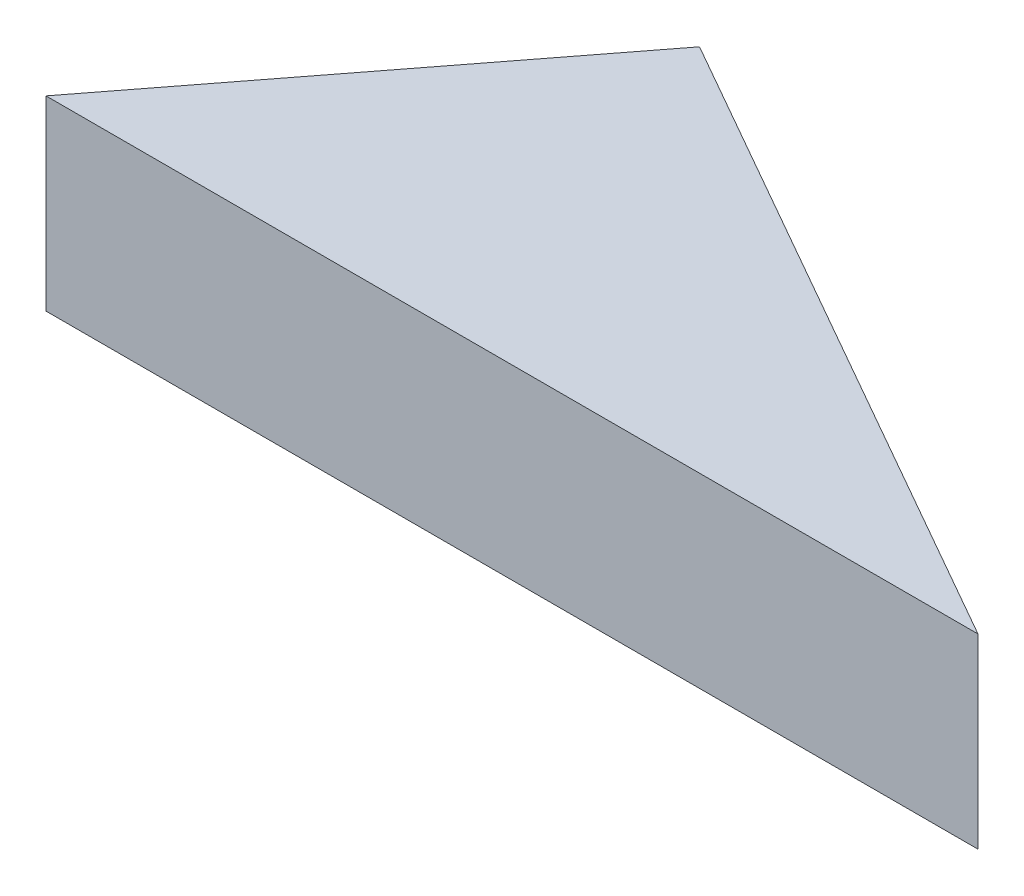
ISO-10303-21;
HEADER;
FILE_DESCRIPTION(('STEP AP214'),'2;1');
FILE_NAME('part.step','',(''),(''),'','','');
FILE_SCHEMA(('AUTOMOTIVE_DESIGN { 1 0 10303 214 1 1 1 1 }'));
ENDSEC;
DATA;
#1=APPLICATION_CONTEXT('core data for automotive mechanical design processes');
#2=APPLICATION_PROTOCOL_DEFINITION('international standard','automotive_design',2000,#1);
#3=PRODUCT_CONTEXT('',#1,'mechanical');
#4=PRODUCT('Part','Part','',(#3));
#5=PRODUCT_RELATED_PRODUCT_CATEGORY('part','',(#4));
#6=PRODUCT_DEFINITION_FORMATION('','',#4);
#7=PRODUCT_DEFINITION_CONTEXT('part definition',#1,'design');
#8=PRODUCT_DEFINITION('design','',#6,#7);
#9=PRODUCT_DEFINITION_SHAPE('','',#8);
#10=(LENGTH_UNIT() NAMED_UNIT(*) SI_UNIT(.MILLI.,.METRE.));
#11=(NAMED_UNIT(*) PLANE_ANGLE_UNIT() SI_UNIT($,.RADIAN.));
#12=(NAMED_UNIT(*) SI_UNIT($,.STERADIAN.) SOLID_ANGLE_UNIT());
#13=UNCERTAINTY_MEASURE_WITH_UNIT(LENGTH_MEASURE(1.E-05),#10,'distance_accuracy_value','');
#14=(GEOMETRIC_REPRESENTATION_CONTEXT(3) GLOBAL_UNCERTAINTY_ASSIGNED_CONTEXT((#13)) GLOBAL_UNIT_ASSIGNED_CONTEXT((#10,
#11,#12)) REPRESENTATION_CONTEXT('',''));
#15=CARTESIAN_POINT('',(0.,0.,0.));
#16=DIRECTION('',(0.,0.,1.));
#17=DIRECTION('',(1.,0.,0.));
#18=AXIS2_PLACEMENT_3D('',#15,#16,#17);
#19=CARTESIAN_POINT('',(1.525,1.,-1.98100353356575));
#20=DIRECTION('',(0.792401413426301,0.,0.61));
#21=DIRECTION('',(0.61,0.,-0.792401413426301));
#22=AXIS2_PLACEMENT_3D('',#19,#20,#21);
#23=PLANE('',#22);
#24=DIRECTION('',(-0.61,0.,0.792401413426301));
#25=VECTOR('',#24,1.);
#26=CARTESIAN_POINT('',(1.525,0.,-1.98100353356575));
#27=LINE('',#26,#25);
#28=CARTESIAN_POINT('',(1.525,0.,-1.98100353356575));
#29=VERTEX_POINT('',#28);
#30=CARTESIAN_POINT('',(0.,0.,0.));
#31=VERTEX_POINT('',#30);
#32=EDGE_CURVE('E80',#29,#31,#27,.T.);
#33=ORIENTED_EDGE('',*,*,#32,.T.);
#34=DIRECTION('',(0.,-1.,0.));
#35=VECTOR('',#34,1.);
#36=CARTESIAN_POINT('',(0.,1.,0.));
#37=LINE('',#36,#35);
#38=CARTESIAN_POINT('',(0.,1.,0.));
#39=VERTEX_POINT('',#38);
#40=EDGE_CURVE('E11',#39,#31,#37,.T.);
#41=ORIENTED_EDGE('',*,*,#40,.F.);
#42=DIRECTION('',(-0.61,0.,0.792401413426301));
#43=VECTOR('',#42,1.);
#44=CARTESIAN_POINT('',(1.525,1.,-1.98100353356575));
#45=LINE('',#44,#43);
#46=CARTESIAN_POINT('',(1.525,1.,-1.98100353356575));
#47=VERTEX_POINT('',#46);
#48=EDGE_CURVE('E73',#47,#39,#45,.T.);
#49=ORIENTED_EDGE('',*,*,#48,.F.);
#50=DIRECTION('',(0.,-1.,0.));
#51=VECTOR('',#50,1.);
#52=CARTESIAN_POINT('',(1.525,1.,-1.98100353356575));
#53=LINE('',#52,#51);
#54=EDGE_CURVE('E81',#47,#29,#53,.T.);
#55=ORIENTED_EDGE('',*,*,#54,.T.);
#56=EDGE_LOOP('',(#33,#41,#49,#55));
#57=FACE_BOUND('',#56,.T.);
#58=ADVANCED_FACE('F33',(#57),#23,.F.);
#59=CARTESIAN_POINT('',(0.,1.,0.));
#60=DIRECTION('',(0.,0.,-1.));
#61=DIRECTION('',(-1.,0.,0.));
#62=AXIS2_PLACEMENT_3D('',#59,#60,#61);
#63=PLANE('',#62);
#64=DIRECTION('',(1.,0.,0.));
#65=VECTOR('',#64,1.);
#66=CARTESIAN_POINT('',(0.,0.,0.));
#67=LINE('',#66,#65);
#68=CARTESIAN_POINT('',(5.,0.,0.));
#69=VERTEX_POINT('',#68);
#70=EDGE_CURVE('E61',#31,#69,#67,.T.);
#71=ORIENTED_EDGE('',*,*,#70,.T.);
#72=DIRECTION('',(0.,-1.,0.));
#73=VECTOR('',#72,1.);
#74=CARTESIAN_POINT('',(5.,1.,0.));
#75=LINE('',#74,#73);
#76=CARTESIAN_POINT('',(5.,1.,0.));
#77=VERTEX_POINT('',#76);
#78=EDGE_CURVE('E41',#77,#69,#75,.T.);
#79=ORIENTED_EDGE('',*,*,#78,.F.);
#80=DIRECTION('',(1.,0.,0.));
#81=VECTOR('',#80,1.);
#82=CARTESIAN_POINT('',(0.,1.,0.));
#83=LINE('',#82,#81);
#84=EDGE_CURVE('E69',#39,#77,#83,.T.);
#85=ORIENTED_EDGE('',*,*,#84,.F.);
#86=ORIENTED_EDGE('',*,*,#40,.T.);
#87=EDGE_LOOP('',(#71,#79,#85,#86));
#88=FACE_BOUND('',#87,.T.);
#89=ADVANCED_FACE('F70',(#88),#63,.F.);
#90=CARTESIAN_POINT('',(5.,1.,0.));
#91=DIRECTION('',(-0.495250883391438,0.,0.86875));
#92=DIRECTION('',(0.86875,0.,0.495250883391438));
#93=AXIS2_PLACEMENT_3D('',#90,#91,#92);
#94=PLANE('',#93);
#95=DIRECTION('',(-0.86875,0.,-0.495250883391438));
#96=VECTOR('',#95,1.);
#97=CARTESIAN_POINT('',(5.,0.,0.));
#98=LINE('',#97,#96);
#99=EDGE_CURVE('E66',#69,#29,#98,.T.);
#100=ORIENTED_EDGE('',*,*,#99,.T.);
#101=ORIENTED_EDGE('',*,*,#54,.F.);
#102=DIRECTION('',(-0.86875,0.,-0.495250883391438));
#103=VECTOR('',#102,1.);
#104=CARTESIAN_POINT('',(5.,1.,0.));
#105=LINE('',#104,#103);
#106=EDGE_CURVE('E49',#77,#47,#105,.T.);
#107=ORIENTED_EDGE('',*,*,#106,.F.);
#108=ORIENTED_EDGE('',*,*,#78,.T.);
#109=EDGE_LOOP('',(#100,#101,#107,#108));
#110=FACE_BOUND('',#109,.T.);
#111=ADVANCED_FACE('F88',(#110),#94,.F.);
#112=CARTESIAN_POINT('',(0.,1.,0.));
#113=DIRECTION('',(0.,-1.,0.));
#114=DIRECTION('',(0.,0.,-1.));
#115=AXIS2_PLACEMENT_3D('',#112,#113,#114);
#116=PLANE('',#115);
#117=ORIENTED_EDGE('',*,*,#48,.T.);
#118=ORIENTED_EDGE('',*,*,#84,.T.);
#119=ORIENTED_EDGE('',*,*,#106,.T.);
#120=EDGE_LOOP('',(#117,#118,#119));
#121=FACE_BOUND('',#120,.T.);
#122=ADVANCED_FACE('F76',(#121),#116,.F.);
#123=CARTESIAN_POINT('',(0.,0.,0.));
#124=DIRECTION('',(0.,-1.,0.));
#125=DIRECTION('',(0.,0.,-1.));
#126=AXIS2_PLACEMENT_3D('',#123,#124,#125);
#127=PLANE('',#126);
#128=ORIENTED_EDGE('',*,*,#32,.F.);
#129=ORIENTED_EDGE('',*,*,#99,.F.);
#130=ORIENTED_EDGE('',*,*,#70,.F.);
#131=EDGE_LOOP('',(#128,#129,#130));
#132=FACE_BOUND('',#131,.T.);
#133=ADVANCED_FACE('F89',(#132),#127,.T.);
#134=CLOSED_SHELL('',(#58,#89,#111,#122,#133));
#135=MANIFOLD_SOLID_BREP('B2',#134);
#136=ADVANCED_BREP_SHAPE_REPRESENTATION('',(#18,#135),#14);
#137=SHAPE_DEFINITION_REPRESENTATION(#9,#136);
ENDSEC;
END-ISO-10303-21;
